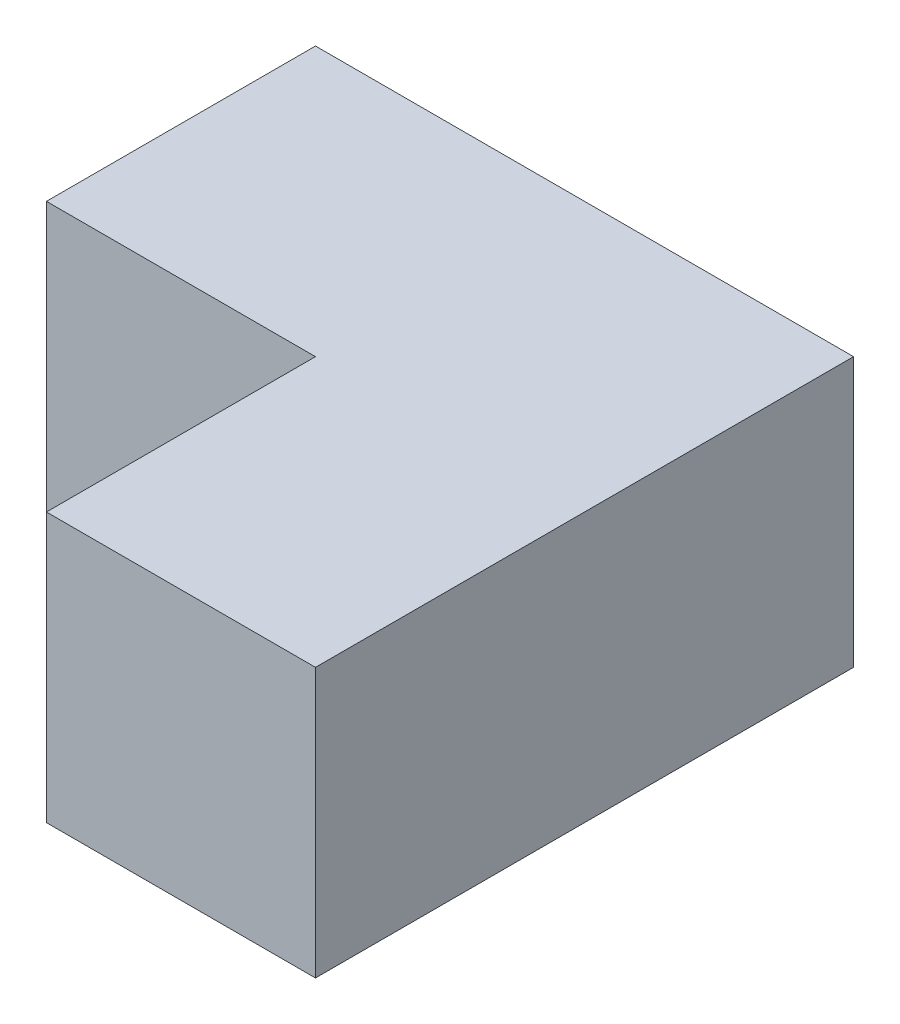
ISO-10303-21;
HEADER;
FILE_DESCRIPTION(('STEP AP214'),'2;1');
FILE_NAME('part.step','',(''),(''),'','','');
FILE_SCHEMA(('AUTOMOTIVE_DESIGN { 1 0 10303 214 1 1 1 1 }'));
ENDSEC;
DATA;
#1=APPLICATION_CONTEXT('core data for automotive mechanical design processes');
#2=APPLICATION_PROTOCOL_DEFINITION('international standard','automotive_design',2000,#1);
#3=PRODUCT_CONTEXT('',#1,'mechanical');
#4=PRODUCT('Part','Part','',(#3));
#5=PRODUCT_RELATED_PRODUCT_CATEGORY('part','',(#4));
#6=PRODUCT_DEFINITION_FORMATION('','',#4);
#7=PRODUCT_DEFINITION_CONTEXT('part definition',#1,'design');
#8=PRODUCT_DEFINITION('design','',#6,#7);
#9=PRODUCT_DEFINITION_SHAPE('','',#8);
#10=(LENGTH_UNIT() NAMED_UNIT(*) SI_UNIT(.MILLI.,.METRE.));
#11=(NAMED_UNIT(*) PLANE_ANGLE_UNIT() SI_UNIT($,.RADIAN.));
#12=(NAMED_UNIT(*) SI_UNIT($,.STERADIAN.) SOLID_ANGLE_UNIT());
#13=UNCERTAINTY_MEASURE_WITH_UNIT(LENGTH_MEASURE(1.E-05),#10,'distance_accuracy_value','');
#14=(GEOMETRIC_REPRESENTATION_CONTEXT(3) GLOBAL_UNCERTAINTY_ASSIGNED_CONTEXT((#13)) GLOBAL_UNIT_ASSIGNED_CONTEXT((#10,
#11,#12)) REPRESENTATION_CONTEXT('',''));
#15=CARTESIAN_POINT('',(0.,0.,0.));
#16=DIRECTION('',(0.,0.,1.));
#17=DIRECTION('',(1.,0.,0.));
#18=AXIS2_PLACEMENT_3D('',#15,#16,#17);
#19=CARTESIAN_POINT('',(0.,200.,0.));
#20=DIRECTION('',(1.,0.,0.));
#21=DIRECTION('',(0.,0.,-1.));
#22=AXIS2_PLACEMENT_3D('',#19,#20,#21);
#23=PLANE('',#22);
#24=DIRECTION('',(0.,0.,1.));
#25=VECTOR('',#24,1.);
#26=CARTESIAN_POINT('',(0.,0.,0.));
#27=LINE('',#26,#25);
#28=CARTESIAN_POINT('',(0.,0.,-200.));
#29=VERTEX_POINT('',#28);
#30=CARTESIAN_POINT('',(0.,0.,0.));
#31=VERTEX_POINT('',#30);
#32=EDGE_CURVE('E128',#29,#31,#27,.T.);
#33=ORIENTED_EDGE('',*,*,#32,.T.);
#34=DIRECTION('',(0.,-1.,0.));
#35=VECTOR('',#34,1.);
#36=CARTESIAN_POINT('',(0.,200.,0.));
#37=LINE('',#36,#35);
#38=CARTESIAN_POINT('',(0.,200.,0.));
#39=VERTEX_POINT('',#38);
#40=EDGE_CURVE('E11',#39,#31,#37,.T.);
#41=ORIENTED_EDGE('',*,*,#40,.F.);
#42=DIRECTION('',(0.,0.,1.));
#43=VECTOR('',#42,1.);
#44=CARTESIAN_POINT('',(0.,200.,0.));
#45=LINE('',#44,#43);
#46=CARTESIAN_POINT('',(0.,200.,-200.));
#47=VERTEX_POINT('',#46);
#48=EDGE_CURVE('E144',#47,#39,#45,.T.);
#49=ORIENTED_EDGE('',*,*,#48,.F.);
#50=DIRECTION('',(0.,-1.,0.));
#51=VECTOR('',#50,1.);
#52=CARTESIAN_POINT('',(0.,200.,-200.));
#53=LINE('',#52,#51);
#54=EDGE_CURVE('E124',#47,#29,#53,.T.);
#55=ORIENTED_EDGE('',*,*,#54,.T.);
#56=EDGE_LOOP('',(#33,#41,#49,#55));
#57=FACE_BOUND('',#56,.T.);
#58=ADVANCED_FACE('F39',(#57),#23,.F.);
#59=CARTESIAN_POINT('',(0.,200.,0.));
#60=DIRECTION('',(0.,0.,-1.));
#61=DIRECTION('',(-1.,0.,0.));
#62=AXIS2_PLACEMENT_3D('',#59,#60,#61);
#63=PLANE('',#62);
#64=DIRECTION('',(1.,0.,0.));
#65=VECTOR('',#64,1.);
#66=CARTESIAN_POINT('',(0.,0.,0.));
#67=LINE('',#66,#65);
#68=CARTESIAN_POINT('',(200.,0.,0.));
#69=VERTEX_POINT('',#68);
#70=EDGE_CURVE('E132',#31,#69,#67,.T.);
#71=ORIENTED_EDGE('',*,*,#70,.T.);
#72=DIRECTION('',(0.,-1.,0.));
#73=VECTOR('',#72,1.);
#74=CARTESIAN_POINT('',(200.,200.,0.));
#75=LINE('',#74,#73);
#76=CARTESIAN_POINT('',(200.,200.,0.));
#77=VERTEX_POINT('',#76);
#78=EDGE_CURVE('E48',#77,#69,#75,.T.);
#79=ORIENTED_EDGE('',*,*,#78,.F.);
#80=DIRECTION('',(1.,0.,0.));
#81=VECTOR('',#80,1.);
#82=CARTESIAN_POINT('',(0.,200.,0.));
#83=LINE('',#82,#81);
#84=EDGE_CURVE('E93',#39,#77,#83,.T.);
#85=ORIENTED_EDGE('',*,*,#84,.F.);
#86=ORIENTED_EDGE('',*,*,#40,.T.);
#87=EDGE_LOOP('',(#71,#79,#85,#86));
#88=FACE_BOUND('',#87,.T.);
#89=ADVANCED_FACE('F172',(#88),#63,.F.);
#90=CARTESIAN_POINT('',(200.,200.,0.));
#91=DIRECTION('',(1.,0.,0.));
#92=DIRECTION('',(0.,0.,-1.));
#93=AXIS2_PLACEMENT_3D('',#90,#91,#92);
#94=PLANE('',#93);
#95=DIRECTION('',(0.,0.,1.));
#96=VECTOR('',#95,1.);
#97=CARTESIAN_POINT('',(200.,0.,0.));
#98=LINE('',#97,#96);
#99=CARTESIAN_POINT('',(200.,0.,200.));
#100=VERTEX_POINT('',#99);
#101=EDGE_CURVE('E135',#69,#100,#98,.T.);
#102=ORIENTED_EDGE('',*,*,#101,.T.);
#103=DIRECTION('',(0.,-1.,0.));
#104=VECTOR('',#103,1.);
#105=CARTESIAN_POINT('',(200.,200.,200.));
#106=LINE('',#105,#104);
#107=CARTESIAN_POINT('',(200.,200.,200.));
#108=VERTEX_POINT('',#107);
#109=EDGE_CURVE('E117',#108,#100,#106,.T.);
#110=ORIENTED_EDGE('',*,*,#109,.F.);
#111=DIRECTION('',(0.,0.,1.));
#112=VECTOR('',#111,1.);
#113=CARTESIAN_POINT('',(200.,200.,0.));
#114=LINE('',#113,#112);
#115=EDGE_CURVE('E106',#77,#108,#114,.T.);
#116=ORIENTED_EDGE('',*,*,#115,.F.);
#117=ORIENTED_EDGE('',*,*,#78,.T.);
#118=EDGE_LOOP('',(#102,#110,#116,#117));
#119=FACE_BOUND('',#118,.T.);
#120=ADVANCED_FACE('F154',(#119),#94,.F.);
#121=CARTESIAN_POINT('',(200.,200.,200.));
#122=DIRECTION('',(0.,0.,-1.));
#123=DIRECTION('',(-1.,0.,0.));
#124=AXIS2_PLACEMENT_3D('',#121,#122,#123);
#125=PLANE('',#124);
#126=DIRECTION('',(1.,0.,0.));
#127=VECTOR('',#126,1.);
#128=CARTESIAN_POINT('',(200.,0.,200.));
#129=LINE('',#128,#127);
#130=CARTESIAN_POINT('',(400.,0.,200.));
#131=VERTEX_POINT('',#130);
#132=EDGE_CURVE('E115',#100,#131,#129,.T.);
#133=ORIENTED_EDGE('',*,*,#132,.T.);
#134=DIRECTION('',(0.,-1.,0.));
#135=VECTOR('',#134,1.);
#136=CARTESIAN_POINT('',(400.,200.,200.));
#137=LINE('',#136,#135);
#138=CARTESIAN_POINT('',(400.,200.,200.));
#139=VERTEX_POINT('',#138);
#140=EDGE_CURVE('E112',#139,#131,#137,.T.);
#141=ORIENTED_EDGE('',*,*,#140,.F.);
#142=DIRECTION('',(1.,0.,0.));
#143=VECTOR('',#142,1.);
#144=CARTESIAN_POINT('',(200.,200.,200.));
#145=LINE('',#144,#143);
#146=EDGE_CURVE('E100',#108,#139,#145,.T.);
#147=ORIENTED_EDGE('',*,*,#146,.F.);
#148=ORIENTED_EDGE('',*,*,#109,.T.);
#149=EDGE_LOOP('',(#133,#141,#147,#148));
#150=FACE_BOUND('',#149,.T.);
#151=ADVANCED_FACE('F113',(#150),#125,.F.);
#152=CARTESIAN_POINT('',(400.,200.,-200.));
#153=DIRECTION('',(-1.,0.,0.));
#154=DIRECTION('',(0.,0.,1.));
#155=AXIS2_PLACEMENT_3D('',#152,#153,#154);
#156=PLANE('',#155);
#157=DIRECTION('',(0.,0.,-1.));
#158=VECTOR('',#157,1.);
#159=CARTESIAN_POINT('',(400.,0.,-200.));
#160=LINE('',#159,#158);
#161=CARTESIAN_POINT('',(400.,0.,-200.));
#162=VERTEX_POINT('',#161);
#163=EDGE_CURVE('E79',#131,#162,#160,.T.);
#164=ORIENTED_EDGE('',*,*,#163,.T.);
#165=DIRECTION('',(0.,-1.,0.));
#166=VECTOR('',#165,1.);
#167=CARTESIAN_POINT('',(400.,200.,-200.));
#168=LINE('',#167,#166);
#169=CARTESIAN_POINT('',(400.,200.,-200.));
#170=VERTEX_POINT('',#169);
#171=EDGE_CURVE('E118',#170,#162,#168,.T.);
#172=ORIENTED_EDGE('',*,*,#171,.F.);
#173=DIRECTION('',(0.,0.,-1.));
#174=VECTOR('',#173,1.);
#175=CARTESIAN_POINT('',(400.,200.,-200.));
#176=LINE('',#175,#174);
#177=EDGE_CURVE('E104',#139,#170,#176,.T.);
#178=ORIENTED_EDGE('',*,*,#177,.F.);
#179=ORIENTED_EDGE('',*,*,#140,.T.);
#180=EDGE_LOOP('',(#164,#172,#178,#179));
#181=FACE_BOUND('',#180,.T.);
#182=ADVANCED_FACE('F120',(#181),#156,.F.);
#183=CARTESIAN_POINT('',(0.,200.,-200.));
#184=DIRECTION('',(0.,0.,1.));
#185=DIRECTION('',(1.,0.,0.));
#186=AXIS2_PLACEMENT_3D('',#183,#184,#185);
#187=PLANE('',#186);
#188=DIRECTION('',(-1.,0.,0.));
#189=VECTOR('',#188,1.);
#190=CARTESIAN_POINT('',(0.,0.,-200.));
#191=LINE('',#190,#189);
#192=EDGE_CURVE('E85',#162,#29,#191,.T.);
#193=ORIENTED_EDGE('',*,*,#192,.T.);
#194=ORIENTED_EDGE('',*,*,#54,.F.);
#195=DIRECTION('',(-1.,0.,0.));
#196=VECTOR('',#195,1.);
#197=CARTESIAN_POINT('',(0.,200.,-200.));
#198=LINE('',#197,#196);
#199=EDGE_CURVE('E56',#170,#47,#198,.T.);
#200=ORIENTED_EDGE('',*,*,#199,.F.);
#201=ORIENTED_EDGE('',*,*,#171,.T.);
#202=EDGE_LOOP('',(#193,#194,#200,#201));
#203=FACE_BOUND('',#202,.T.);
#204=ADVANCED_FACE('F161',(#203),#187,.F.);
#205=CARTESIAN_POINT('',(0.,200.,0.));
#206=DIRECTION('',(0.,-1.,0.));
#207=DIRECTION('',(0.,0.,-1.));
#208=AXIS2_PLACEMENT_3D('',#205,#206,#207);
#209=PLANE('',#208);
#210=ORIENTED_EDGE('',*,*,#48,.T.);
#211=ORIENTED_EDGE('',*,*,#84,.T.);
#212=ORIENTED_EDGE('',*,*,#115,.T.);
#213=ORIENTED_EDGE('',*,*,#146,.T.);
#214=ORIENTED_EDGE('',*,*,#177,.T.);
#215=ORIENTED_EDGE('',*,*,#199,.T.);
#216=EDGE_LOOP('',(#210,#211,#212,#213,#214,#215));
#217=FACE_BOUND('',#216,.T.);
#218=ADVANCED_FACE('F102',(#217),#209,.F.);
#219=CARTESIAN_POINT('',(0.,0.,0.));
#220=DIRECTION('',(0.,-1.,0.));
#221=DIRECTION('',(0.,0.,-1.));
#222=AXIS2_PLACEMENT_3D('',#219,#220,#221);
#223=PLANE('',#222);
#224=ORIENTED_EDGE('',*,*,#32,.F.);
#225=ORIENTED_EDGE('',*,*,#192,.F.);
#226=ORIENTED_EDGE('',*,*,#163,.F.);
#227=ORIENTED_EDGE('',*,*,#132,.F.);
#228=ORIENTED_EDGE('',*,*,#101,.F.);
#229=ORIENTED_EDGE('',*,*,#70,.F.);
#230=EDGE_LOOP('',(#224,#225,#226,#227,#228,#229));
#231=FACE_BOUND('',#230,.T.);
#232=ADVANCED_FACE('F157',(#231),#223,.T.);
#233=CLOSED_SHELL('',(#58,#89,#120,#151,#182,#204,#218,#232));
#234=MANIFOLD_SOLID_BREP('B2',#233);
#235=ADVANCED_BREP_SHAPE_REPRESENTATION('',(#18,#234),#14);
#236=SHAPE_DEFINITION_REPRESENTATION(#9,#235);
ENDSEC;
END-ISO-10303-21;
